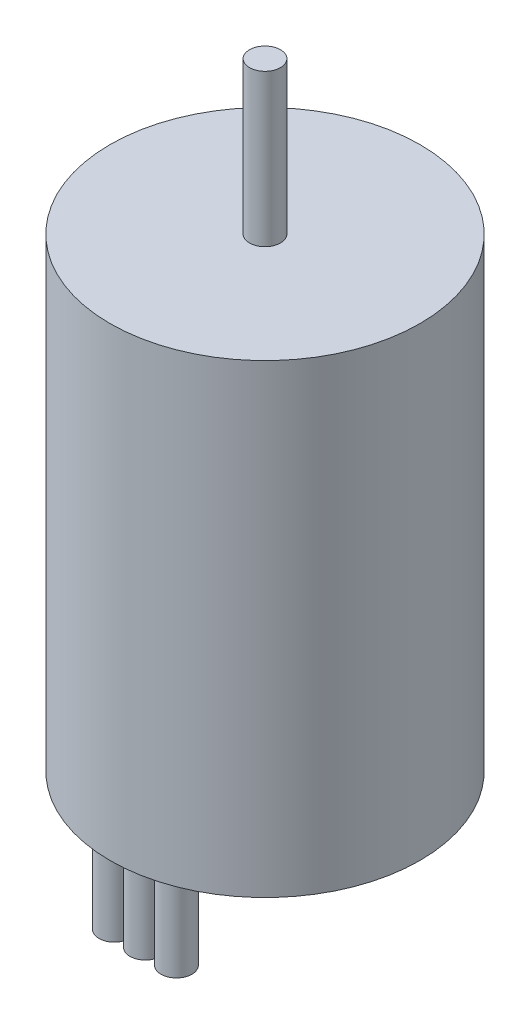
ISO-10303-21;
HEADER;
FILE_DESCRIPTION(('STEP AP214'),'2;1');
FILE_NAME('part.step','',(''),(''),'','','');
FILE_SCHEMA(('AUTOMOTIVE_DESIGN { 1 0 10303 214 1 1 1 1 }'));
ENDSEC;
DATA;
#1=APPLICATION_CONTEXT('core data for automotive mechanical design processes');
#2=APPLICATION_PROTOCOL_DEFINITION('international standard','automotive_design',2000,#1);
#3=PRODUCT_CONTEXT('',#1,'mechanical');
#4=PRODUCT('Part','Part','',(#3));
#5=PRODUCT_RELATED_PRODUCT_CATEGORY('part','',(#4));
#6=PRODUCT_DEFINITION_FORMATION('','',#4);
#7=PRODUCT_DEFINITION_CONTEXT('part definition',#1,'design');
#8=PRODUCT_DEFINITION('design','',#6,#7);
#9=PRODUCT_DEFINITION_SHAPE('','',#8);
#10=(LENGTH_UNIT() NAMED_UNIT(*) SI_UNIT(.MILLI.,.METRE.));
#11=(NAMED_UNIT(*) PLANE_ANGLE_UNIT() SI_UNIT($,.RADIAN.));
#12=(NAMED_UNIT(*) SI_UNIT($,.STERADIAN.) SOLID_ANGLE_UNIT());
#13=UNCERTAINTY_MEASURE_WITH_UNIT(LENGTH_MEASURE(1.E-05),#10,'distance_accuracy_value','');
#14=(GEOMETRIC_REPRESENTATION_CONTEXT(3) GLOBAL_UNCERTAINTY_ASSIGNED_CONTEXT((#13)) GLOBAL_UNIT_ASSIGNED_CONTEXT((#10,
#11,#12)) REPRESENTATION_CONTEXT('',''));
#15=CARTESIAN_POINT('',(0.,0.,0.));
#16=DIRECTION('',(0.,0.,1.));
#17=DIRECTION('',(1.,0.,0.));
#18=AXIS2_PLACEMENT_3D('',#15,#16,#17);
#19=CARTESIAN_POINT('',(-2.,-6.,10.3375938450349));
#20=DIRECTION('',(0.,-1.,0.));
#21=DIRECTION('',(0.,0.,-1.));
#22=AXIS2_PLACEMENT_3D('',#19,#20,#21);
#23=PLANE('',#22);
#24=CARTESIAN_POINT('',(-2.,-6.,10.3375938450349));
#25=DIRECTION('',(0.,-1.,0.));
#26=DIRECTION('',(1.,0.,0.));
#27=AXIS2_PLACEMENT_3D('',#24,#25,#26);
#28=CIRCLE('',#27,1.);
#29=CARTESIAN_POINT('',(-1.,-6.,10.3375938450349));
#30=VERTEX_POINT('',#29);
#31=CARTESIAN_POINT('',(-3.,-6.,10.3375938450349));
#32=VERTEX_POINT('',#31);
#33=EDGE_CURVE('E39',#30,#32,#28,.T.);
#34=ORIENTED_EDGE('',*,*,#33,.T.);
#35=CARTESIAN_POINT('',(-2.,-6.,10.3375938450349));
#36=DIRECTION('',(0.,-1.,0.));
#37=DIRECTION('',(1.,0.,0.));
#38=AXIS2_PLACEMENT_3D('',#35,#36,#37);
#39=CIRCLE('',#38,1.);
#40=EDGE_CURVE('E11',#32,#30,#39,.T.);
#41=ORIENTED_EDGE('',*,*,#40,.T.);
#42=EDGE_LOOP('',(#34,#41));
#43=FACE_BOUND('',#42,.T.);
#44=ADVANCED_FACE('F16',(#43),#23,.T.);
#45=CARTESIAN_POINT('',(-2.,0.,10.3375938450349));
#46=DIRECTION('',(0.,-1.,0.));
#47=DIRECTION('',(1.,0.,0.));
#48=AXIS2_PLACEMENT_3D('',#45,#46,#47);
#49=CYLINDRICAL_SURFACE('',#48,1.);
#50=DIRECTION('',(0.,1.,0.));
#51=VECTOR('',#50,1.);
#52=CARTESIAN_POINT('',(-3.,0.,10.3375938450349));
#53=LINE('',#52,#51);
#54=CARTESIAN_POINT('',(-3.,0.,10.3375938450349));
#55=VERTEX_POINT('',#54);
#56=EDGE_CURVE('E93',#32,#55,#53,.T.);
#57=ORIENTED_EDGE('',*,*,#56,.T.);
#58=CARTESIAN_POINT('',(-2.,0.,10.3375938450349));
#59=DIRECTION('',(0.,-1.,0.));
#60=DIRECTION('',(1.,0.,0.));
#61=AXIS2_PLACEMENT_3D('',#58,#59,#60);
#62=CIRCLE('',#61,1.);
#63=CARTESIAN_POINT('',(-1.,0.,10.3375938450349));
#64=VERTEX_POINT('',#63);
#65=EDGE_CURVE('E129',#55,#64,#62,.T.);
#66=ORIENTED_EDGE('',*,*,#65,.T.);
#67=DIRECTION('',(0.,-1.,0.));
#68=VECTOR('',#67,1.);
#69=CARTESIAN_POINT('',(-1.,0.,10.3375938450349));
#70=LINE('',#69,#68);
#71=EDGE_CURVE('E94',#64,#30,#70,.T.);
#72=ORIENTED_EDGE('',*,*,#71,.T.);
#73=ORIENTED_EDGE('',*,*,#40,.F.);
#74=EDGE_LOOP('',(#57,#66,#72,#73));
#75=FACE_BOUND('',#74,.T.);
#76=ADVANCED_FACE('F91',(#75),#49,.T.);
#77=CARTESIAN_POINT('',(0.,-6.,10.3375938450349));
#78=DIRECTION('',(0.,-1.,0.));
#79=DIRECTION('',(0.,0.,-1.));
#80=AXIS2_PLACEMENT_3D('',#77,#78,#79);
#81=PLANE('',#80);
#82=CARTESIAN_POINT('',(0.,-6.,10.3375938450349));
#83=DIRECTION('',(0.,-1.,0.));
#84=DIRECTION('',(1.,0.,0.));
#85=AXIS2_PLACEMENT_3D('',#82,#83,#84);
#86=CIRCLE('',#85,1.);
#87=CARTESIAN_POINT('',(-1.,-6.,10.3375938450349));
#88=VERTEX_POINT('',#87);
#89=CARTESIAN_POINT('',(1.,-6.,10.3375938450349));
#90=VERTEX_POINT('',#89);
#91=EDGE_CURVE('E26',#88,#90,#86,.T.);
#92=ORIENTED_EDGE('',*,*,#91,.T.);
#93=CARTESIAN_POINT('',(0.,-6.,10.3375938450349));
#94=DIRECTION('',(0.,-1.,0.));
#95=DIRECTION('',(1.,0.,0.));
#96=AXIS2_PLACEMENT_3D('',#93,#94,#95);
#97=CIRCLE('',#96,1.);
#98=EDGE_CURVE('E147',#90,#88,#97,.T.);
#99=ORIENTED_EDGE('',*,*,#98,.T.);
#100=EDGE_LOOP('',(#92,#99));
#101=FACE_BOUND('',#100,.T.);
#102=ADVANCED_FACE('F237',(#101),#81,.T.);
#103=CARTESIAN_POINT('',(0.,0.,10.3375938450349));
#104=DIRECTION('',(0.,-1.,0.));
#105=DIRECTION('',(1.,0.,0.));
#106=AXIS2_PLACEMENT_3D('',#103,#104,#105);
#107=CYLINDRICAL_SURFACE('',#106,1.);
#108=DIRECTION('',(0.,-1.,0.));
#109=VECTOR('',#108,1.);
#110=CARTESIAN_POINT('',(1.,0.,10.3375938450349));
#111=LINE('',#110,#109);
#112=CARTESIAN_POINT('',(1.,0.,10.3375938450349));
#113=VERTEX_POINT('',#112);
#114=EDGE_CURVE('E49',#113,#90,#111,.T.);
#115=ORIENTED_EDGE('',*,*,#114,.T.);
#116=ORIENTED_EDGE('',*,*,#91,.F.);
#117=DIRECTION('',(0.,-1.,0.));
#118=VECTOR('',#117,1.);
#119=CARTESIAN_POINT('',(-1.,0.,10.3375938450349));
#120=LINE('',#119,#118);
#121=EDGE_CURVE('E150',#64,#88,#120,.T.);
#122=ORIENTED_EDGE('',*,*,#121,.F.);
#123=CARTESIAN_POINT('',(0.,0.,10.3375938450349));
#124=DIRECTION('',(0.,-1.,0.));
#125=DIRECTION('',(1.,0.,0.));
#126=AXIS2_PLACEMENT_3D('',#123,#124,#125);
#127=CIRCLE('',#126,1.);
#128=EDGE_CURVE('E136',#64,#113,#127,.T.);
#129=ORIENTED_EDGE('',*,*,#128,.T.);
#130=EDGE_LOOP('',(#115,#116,#122,#129));
#131=FACE_BOUND('',#130,.T.);
#132=ADVANCED_FACE('F235',(#131),#107,.T.);
#133=CARTESIAN_POINT('',(0.,0.,10.3375938450349));
#134=DIRECTION('',(0.,-1.,0.));
#135=DIRECTION('',(1.,0.,0.));
#136=AXIS2_PLACEMENT_3D('',#133,#134,#135);
#137=CYLINDRICAL_SURFACE('',#136,1.);
#138=ORIENTED_EDGE('',*,*,#114,.F.);
#139=CARTESIAN_POINT('',(0.,0.,10.3375938450349));
#140=DIRECTION('',(0.,-1.,0.));
#141=DIRECTION('',(1.,0.,0.));
#142=AXIS2_PLACEMENT_3D('',#139,#140,#141);
#143=CIRCLE('',#142,1.);
#144=EDGE_CURVE('E20',#113,#64,#143,.T.);
#145=ORIENTED_EDGE('',*,*,#144,.T.);
#146=ORIENTED_EDGE('',*,*,#121,.T.);
#147=ORIENTED_EDGE('',*,*,#98,.F.);
#148=EDGE_LOOP('',(#138,#145,#146,#147));
#149=FACE_BOUND('',#148,.T.);
#150=ADVANCED_FACE('F234',(#149),#137,.T.);
#151=CARTESIAN_POINT('',(2.,-6.,10.3375938450349));
#152=DIRECTION('',(0.,-1.,0.));
#153=DIRECTION('',(0.,0.,-1.));
#154=AXIS2_PLACEMENT_3D('',#151,#152,#153);
#155=PLANE('',#154);
#156=CARTESIAN_POINT('',(2.,-6.,10.3375938450349));
#157=DIRECTION('',(0.,-1.,0.));
#158=DIRECTION('',(1.,0.,0.));
#159=AXIS2_PLACEMENT_3D('',#156,#157,#158);
#160=CIRCLE('',#159,1.);
#161=CARTESIAN_POINT('',(1.,-6.,10.3375938450349));
#162=VERTEX_POINT('',#161);
#163=EDGE_CURVE('E208',#162,#162,#160,.T.);
#164=ORIENTED_EDGE('',*,*,#163,.T.);
#165=EDGE_LOOP('',(#164));
#166=FACE_BOUND('',#165,.T.);
#167=ADVANCED_FACE('F280',(#166),#155,.T.);
#168=CARTESIAN_POINT('',(2.,0.,10.3375938450349));
#169=DIRECTION('',(0.,-1.,0.));
#170=DIRECTION('',(1.,0.,0.));
#171=AXIS2_PLACEMENT_3D('',#168,#169,#170);
#172=CYLINDRICAL_SURFACE('',#171,1.);
#173=CARTESIAN_POINT('',(2.,0.,10.3375938450349));
#174=DIRECTION('',(0.,-1.,0.));
#175=DIRECTION('',(1.,0.,0.));
#176=AXIS2_PLACEMENT_3D('',#173,#174,#175);
#177=CIRCLE('',#176,1.);
#178=EDGE_CURVE('E142',#113,#113,#177,.T.);
#179=ORIENTED_EDGE('',*,*,#178,.T.);
#180=DIRECTION('',(0.,-1.,0.));
#181=VECTOR('',#180,1.);
#182=CARTESIAN_POINT('',(1.,0.,10.3375938450349));
#183=LINE('',#182,#181);
#184=EDGE_CURVE('E212',#113,#162,#183,.T.);
#185=ORIENTED_EDGE('',*,*,#184,.T.);
#186=ORIENTED_EDGE('',*,*,#163,.F.);
#187=ORIENTED_EDGE('',*,*,#184,.F.);
#188=EDGE_LOOP('',(#179,#185,#186,#187));
#189=FACE_BOUND('',#188,.T.);
#190=ADVANCED_FACE('F255',(#189),#172,.T.);
#191=CARTESIAN_POINT('',(0.,30.,2.62406438216944));
#192=DIRECTION('',(0.,1.,0.));
#193=DIRECTION('',(1.,0.,0.));
#194=AXIS2_PLACEMENT_3D('',#191,#192,#193);
#195=PLANE('',#194);
#196=CARTESIAN_POINT('',(0.,30.,2.62406438216944));
#197=DIRECTION('',(0.,-1.,0.));
#198=DIRECTION('',(-1.,0.,0.));
#199=AXIS2_PLACEMENT_3D('',#196,#197,#198);
#200=CIRCLE('',#199,1.);
#201=CARTESIAN_POINT('',(1.,30.,2.62406438216944));
#202=VERTEX_POINT('',#201);
#203=EDGE_CURVE('E113',#202,#202,#200,.T.);
#204=ORIENTED_EDGE('',*,*,#203,.T.);
#205=EDGE_LOOP('',(#204));
#206=FACE_BOUND('',#205,.T.);
#207=CARTESIAN_POINT('',(0.,30.,2.62406438216944));
#208=DIRECTION('',(0.,1.,0.));
#209=DIRECTION('',(1.,0.,0.));
#210=AXIS2_PLACEMENT_3D('',#207,#208,#209);
#211=CIRCLE('',#210,10.);
#212=CARTESIAN_POINT('',(-10.,30.,2.62406438216944));
#213=VERTEX_POINT('',#212);
#214=EDGE_CURVE('E121',#213,#213,#211,.T.);
#215=ORIENTED_EDGE('',*,*,#214,.T.);
#216=EDGE_LOOP('',(#215));
#217=FACE_BOUND('',#216,.T.);
#218=ADVANCED_FACE('F260',(#206,#217),#195,.T.);
#219=CARTESIAN_POINT('',(0.,0.,2.62406438216944));
#220=DIRECTION('',(0.,1.,0.));
#221=DIRECTION('',(1.,0.,0.));
#222=AXIS2_PLACEMENT_3D('',#219,#220,#221);
#223=CYLINDRICAL_SURFACE('',#222,10.);
#224=ORIENTED_EDGE('',*,*,#214,.F.);
#225=DIRECTION('',(0.,-1.,0.));
#226=VECTOR('',#225,1.);
#227=CARTESIAN_POINT('',(-10.,0.,2.62406438216944));
#228=LINE('',#227,#226);
#229=CARTESIAN_POINT('',(-10.,0.,2.62406438216944));
#230=VERTEX_POINT('',#229);
#231=EDGE_CURVE('E219',#213,#230,#228,.T.);
#232=ORIENTED_EDGE('',*,*,#231,.T.);
#233=CARTESIAN_POINT('',(0.,0.,2.62406438216944));
#234=DIRECTION('',(0.,1.,0.));
#235=DIRECTION('',(1.,0.,0.));
#236=AXIS2_PLACEMENT_3D('',#233,#234,#235);
#237=CIRCLE('',#236,10.);
#238=EDGE_CURVE('E155',#230,#230,#237,.T.);
#239=ORIENTED_EDGE('',*,*,#238,.T.);
#240=ORIENTED_EDGE('',*,*,#231,.F.);
#241=EDGE_LOOP('',(#224,#232,#239,#240));
#242=FACE_BOUND('',#241,.T.);
#243=ADVANCED_FACE('F257',(#242),#223,.T.);
#244=CARTESIAN_POINT('',(0.,39.8,2.62406438216944));
#245=DIRECTION('',(0.,1.,0.));
#246=DIRECTION('',(1.,0.,0.));
#247=AXIS2_PLACEMENT_3D('',#244,#245,#246);
#248=PLANE('',#247);
#249=CARTESIAN_POINT('',(0.,39.8,2.62406438216944));
#250=DIRECTION('',(0.,1.,0.));
#251=DIRECTION('',(-1.,0.,0.));
#252=AXIS2_PLACEMENT_3D('',#249,#250,#251);
#253=CIRCLE('',#252,1.);
#254=CARTESIAN_POINT('',(1.,39.8,2.62406438216944));
#255=VERTEX_POINT('',#254);
#256=EDGE_CURVE('E108',#255,#255,#253,.T.);
#257=ORIENTED_EDGE('',*,*,#256,.T.);
#258=EDGE_LOOP('',(#257));
#259=FACE_BOUND('',#258,.T.);
#260=ADVANCED_FACE('F259',(#259),#248,.T.);
#261=CARTESIAN_POINT('',(0.,30.,2.62406438216944));
#262=DIRECTION('',(0.,1.,0.));
#263=DIRECTION('',(-1.,0.,0.));
#264=AXIS2_PLACEMENT_3D('',#261,#262,#263);
#265=CYLINDRICAL_SURFACE('',#264,1.);
#266=ORIENTED_EDGE('',*,*,#256,.F.);
#267=DIRECTION('',(0.,-1.,0.));
#268=VECTOR('',#267,1.);
#269=CARTESIAN_POINT('',(1.,30.,2.62406438216944));
#270=LINE('',#269,#268);
#271=EDGE_CURVE('E110',#255,#202,#270,.T.);
#272=ORIENTED_EDGE('',*,*,#271,.T.);
#273=ORIENTED_EDGE('',*,*,#203,.F.);
#274=ORIENTED_EDGE('',*,*,#271,.F.);
#275=EDGE_LOOP('',(#266,#272,#273,#274));
#276=FACE_BOUND('',#275,.T.);
#277=ADVANCED_FACE('F18',(#276),#265,.T.);
#278=CARTESIAN_POINT('',(0.,0.,2.62406438216944));
#279=DIRECTION('',(0.,1.,0.));
#280=DIRECTION('',(1.,0.,0.));
#281=AXIS2_PLACEMENT_3D('',#278,#279,#280);
#282=PLANE('',#281);
#283=ORIENTED_EDGE('',*,*,#178,.F.);
#284=ORIENTED_EDGE('',*,*,#128,.F.);
#285=ORIENTED_EDGE('',*,*,#65,.F.);
#286=CARTESIAN_POINT('',(-2.,0.,10.3375938450349));
#287=DIRECTION('',(0.,-1.,0.));
#288=DIRECTION('',(1.,0.,0.));
#289=AXIS2_PLACEMENT_3D('',#286,#287,#288);
#290=CIRCLE('',#289,1.);
#291=EDGE_CURVE('E101',#64,#55,#290,.T.);
#292=ORIENTED_EDGE('',*,*,#291,.F.);
#293=ORIENTED_EDGE('',*,*,#144,.F.);
#294=EDGE_LOOP('',(#283,#284,#285,#292,#293));
#295=FACE_BOUND('',#294,.T.);
#296=ORIENTED_EDGE('',*,*,#238,.F.);
#297=EDGE_LOOP('',(#296));
#298=FACE_BOUND('',#297,.T.);
#299=ADVANCED_FACE('F264',(#295,#298),#282,.F.);
#300=CARTESIAN_POINT('',(-2.,0.,10.3375938450349));
#301=DIRECTION('',(0.,-1.,0.));
#302=DIRECTION('',(1.,0.,0.));
#303=AXIS2_PLACEMENT_3D('',#300,#301,#302);
#304=CYLINDRICAL_SURFACE('',#303,1.);
#305=ORIENTED_EDGE('',*,*,#56,.F.);
#306=ORIENTED_EDGE('',*,*,#33,.F.);
#307=ORIENTED_EDGE('',*,*,#71,.F.);
#308=ORIENTED_EDGE('',*,*,#291,.T.);
#309=EDGE_LOOP('',(#305,#306,#307,#308));
#310=FACE_BOUND('',#309,.T.);
#311=ADVANCED_FACE('F99',(#310),#304,.T.);
#312=CLOSED_SHELL('',(#44,#76,#102,#132,#150,#167,#190,#218,#243,#260,#277,#299,#311));
#313=MANIFOLD_SOLID_BREP('B1',#312);
#314=ADVANCED_BREP_SHAPE_REPRESENTATION('',(#18,#313),#14);
#315=SHAPE_DEFINITION_REPRESENTATION(#9,#314);
ENDSEC;
END-ISO-10303-21;
